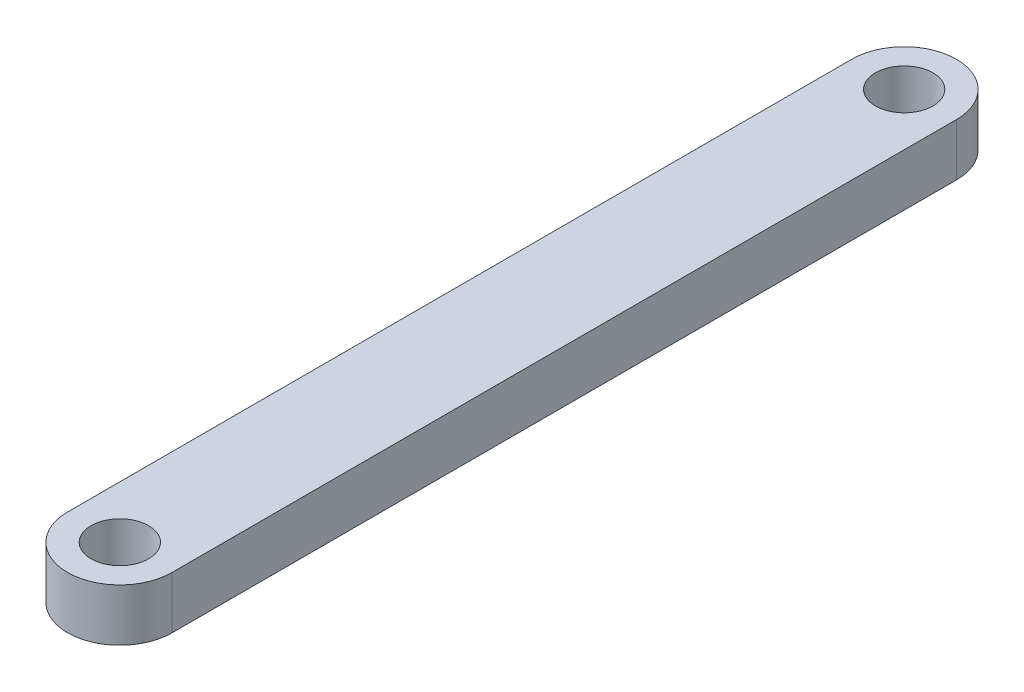
ISO-10303-21;
HEADER;
FILE_DESCRIPTION(('STEP AP214'),'2;1');
FILE_NAME('part.step','',(''),(''),'','','');
FILE_SCHEMA(('AUTOMOTIVE_DESIGN { 1 0 10303 214 1 1 1 1 }'));
ENDSEC;
DATA;
#1=APPLICATION_CONTEXT('core data for automotive mechanical design processes');
#2=APPLICATION_PROTOCOL_DEFINITION('international standard','automotive_design',2000,#1);
#3=PRODUCT_CONTEXT('',#1,'mechanical');
#4=PRODUCT('Part','Part','',(#3));
#5=PRODUCT_RELATED_PRODUCT_CATEGORY('part','',(#4));
#6=PRODUCT_DEFINITION_FORMATION('','',#4);
#7=PRODUCT_DEFINITION_CONTEXT('part definition',#1,'design');
#8=PRODUCT_DEFINITION('design','',#6,#7);
#9=PRODUCT_DEFINITION_SHAPE('','',#8);
#10=(LENGTH_UNIT() NAMED_UNIT(*) SI_UNIT(.MILLI.,.METRE.));
#11=(NAMED_UNIT(*) PLANE_ANGLE_UNIT() SI_UNIT($,.RADIAN.));
#12=(NAMED_UNIT(*) SI_UNIT($,.STERADIAN.) SOLID_ANGLE_UNIT());
#13=UNCERTAINTY_MEASURE_WITH_UNIT(LENGTH_MEASURE(1.E-05),#10,'distance_accuracy_value','');
#14=(GEOMETRIC_REPRESENTATION_CONTEXT(3) GLOBAL_UNCERTAINTY_ASSIGNED_CONTEXT((#13)) GLOBAL_UNIT_ASSIGNED_CONTEXT((#10,
#11,#12)) REPRESENTATION_CONTEXT('',''));
#15=CARTESIAN_POINT('',(0.,0.,0.));
#16=DIRECTION('',(0.,0.,1.));
#17=DIRECTION('',(1.,0.,0.));
#18=AXIS2_PLACEMENT_3D('',#15,#16,#17);
#19=CARTESIAN_POINT('',(-4.99999999999999,5.,0.));
#20=DIRECTION('',(1.,0.,0.));
#21=DIRECTION('',(0.,0.,-1.));
#22=AXIS2_PLACEMENT_3D('',#19,#20,#21);
#23=PLANE('',#22);
#24=DIRECTION('',(0.,0.,1.));
#25=VECTOR('',#24,1.);
#26=CARTESIAN_POINT('',(-4.99999999999999,0.,0.));
#27=LINE('',#26,#25);
#28=CARTESIAN_POINT('',(-5.,0.,-75.));
#29=VERTEX_POINT('',#28);
#30=CARTESIAN_POINT('',(-4.99999999999999,0.,0.));
#31=VERTEX_POINT('',#30);
#32=EDGE_CURVE('E102',#29,#31,#27,.T.);
#33=ORIENTED_EDGE('',*,*,#32,.T.);
#34=DIRECTION('',(0.,-1.,0.));
#35=VECTOR('',#34,1.);
#36=CARTESIAN_POINT('',(-4.99999999999999,5.,0.));
#37=LINE('',#36,#35);
#38=CARTESIAN_POINT('',(-4.99999999999999,5.,0.));
#39=VERTEX_POINT('',#38);
#40=EDGE_CURVE('E11',#39,#31,#37,.T.);
#41=ORIENTED_EDGE('',*,*,#40,.F.);
#42=DIRECTION('',(0.,0.,1.));
#43=VECTOR('',#42,1.);
#44=CARTESIAN_POINT('',(-4.99999999999999,5.,0.));
#45=LINE('',#44,#43);
#46=CARTESIAN_POINT('',(-5.,5.,-75.));
#47=VERTEX_POINT('',#46);
#48=EDGE_CURVE('E81',#47,#39,#45,.T.);
#49=ORIENTED_EDGE('',*,*,#48,.F.);
#50=DIRECTION('',(0.,-1.,0.));
#51=VECTOR('',#50,1.);
#52=CARTESIAN_POINT('',(-5.,5.,-75.));
#53=LINE('',#52,#51);
#54=EDGE_CURVE('E92',#47,#29,#53,.T.);
#55=ORIENTED_EDGE('',*,*,#54,.T.);
#56=EDGE_LOOP('',(#33,#41,#49,#55));
#57=FACE_BOUND('',#56,.T.);
#58=ADVANCED_FACE('F33',(#57),#23,.F.);
#59=CARTESIAN_POINT('',(0.,5.,0.));
#60=DIRECTION('',(0.,-1.,0.));
#61=DIRECTION('',(0.,0.,-1.));
#62=AXIS2_PLACEMENT_3D('',#59,#60,#61);
#63=CYLINDRICAL_SURFACE('',#62,5.);
#64=CARTESIAN_POINT('',(0.,0.,0.));
#65=DIRECTION('',(0.,1.,0.));
#66=DIRECTION('',(0.,0.,1.));
#67=AXIS2_PLACEMENT_3D('',#64,#65,#66);
#68=CIRCLE('',#67,5.);
#69=CARTESIAN_POINT('',(5.00000000000001,0.,0.));
#70=VERTEX_POINT('',#69);
#71=EDGE_CURVE('E86',#31,#70,#68,.T.);
#72=ORIENTED_EDGE('',*,*,#71,.T.);
#73=DIRECTION('',(0.,-1.,0.));
#74=VECTOR('',#73,1.);
#75=CARTESIAN_POINT('',(5.00000000000001,5.,0.));
#76=LINE('',#75,#74);
#77=CARTESIAN_POINT('',(5.00000000000001,5.,0.));
#78=VERTEX_POINT('',#77);
#79=EDGE_CURVE('E42',#78,#70,#76,.T.);
#80=ORIENTED_EDGE('',*,*,#79,.F.);
#81=CARTESIAN_POINT('',(0.,5.,0.));
#82=DIRECTION('',(0.,1.,0.));
#83=DIRECTION('',(0.,0.,1.));
#84=AXIS2_PLACEMENT_3D('',#81,#82,#83);
#85=CIRCLE('',#84,5.);
#86=EDGE_CURVE('E76',#39,#78,#85,.T.);
#87=ORIENTED_EDGE('',*,*,#86,.F.);
#88=ORIENTED_EDGE('',*,*,#40,.T.);
#89=EDGE_LOOP('',(#72,#80,#87,#88));
#90=FACE_BOUND('',#89,.T.);
#91=ADVANCED_FACE('F85',(#90),#63,.T.);
#92=CARTESIAN_POINT('',(5.00000000000001,5.,0.));
#93=DIRECTION('',(1.,0.,0.));
#94=DIRECTION('',(0.,0.,-1.));
#95=AXIS2_PLACEMENT_3D('',#92,#93,#94);
#96=PLANE('',#95);
#97=DIRECTION('',(0.,0.,1.));
#98=VECTOR('',#97,1.);
#99=CARTESIAN_POINT('',(5.00000000000001,0.,0.));
#100=LINE('',#99,#98);
#101=CARTESIAN_POINT('',(5.,0.,-75.));
#102=VERTEX_POINT('',#101);
#103=EDGE_CURVE('E106',#102,#70,#100,.T.);
#104=ORIENTED_EDGE('',*,*,#103,.F.);
#105=DIRECTION('',(0.,-1.,0.));
#106=VECTOR('',#105,1.);
#107=CARTESIAN_POINT('',(5.,5.,-75.));
#108=LINE('',#107,#106);
#109=CARTESIAN_POINT('',(5.,5.,-75.));
#110=VERTEX_POINT('',#109);
#111=EDGE_CURVE('E66',#110,#102,#108,.T.);
#112=ORIENTED_EDGE('',*,*,#111,.F.);
#113=DIRECTION('',(0.,0.,1.));
#114=VECTOR('',#113,1.);
#115=CARTESIAN_POINT('',(5.00000000000001,5.,0.));
#116=LINE('',#115,#114);
#117=EDGE_CURVE('E79',#110,#78,#116,.T.);
#118=ORIENTED_EDGE('',*,*,#117,.T.);
#119=ORIENTED_EDGE('',*,*,#79,.T.);
#120=EDGE_LOOP('',(#104,#112,#118,#119));
#121=FACE_BOUND('',#120,.T.);
#122=ADVANCED_FACE('F90',(#121),#96,.T.);
#123=CARTESIAN_POINT('',(0.,5.,0.));
#124=DIRECTION('',(0.,-1.,0.));
#125=DIRECTION('',(0.,0.,-1.));
#126=AXIS2_PLACEMENT_3D('',#123,#124,#125);
#127=CYLINDRICAL_SURFACE('',#126,2.75);
#128=CARTESIAN_POINT('',(0.,5.,0.));
#129=DIRECTION('',(0.,1.,0.));
#130=DIRECTION('',(0.,0.,1.));
#131=AXIS2_PLACEMENT_3D('',#128,#129,#130);
#132=CIRCLE('',#131,2.75);
#133=CARTESIAN_POINT('',(0.,5.,2.75));
#134=VERTEX_POINT('',#133);
#135=EDGE_CURVE('E144',#134,#134,#132,.T.);
#136=ORIENTED_EDGE('',*,*,#135,.T.);
#137=EDGE_LOOP('',(#136));
#138=FACE_BOUND('',#137,.T.);
#139=CARTESIAN_POINT('',(0.,0.,0.));
#140=DIRECTION('',(0.,1.,0.));
#141=DIRECTION('',(0.,0.,1.));
#142=AXIS2_PLACEMENT_3D('',#139,#140,#141);
#143=CIRCLE('',#142,2.75);
#144=CARTESIAN_POINT('',(0.,0.,2.75));
#145=VERTEX_POINT('',#144);
#146=EDGE_CURVE('E99',#145,#145,#143,.T.);
#147=ORIENTED_EDGE('',*,*,#146,.F.);
#148=EDGE_LOOP('',(#147));
#149=FACE_BOUND('',#148,.T.);
#150=ADVANCED_FACE('F133',(#138,#149),#127,.F.);
#151=CARTESIAN_POINT('',(0.,5.,-75.));
#152=DIRECTION('',(0.,-1.,0.));
#153=DIRECTION('',(0.,0.,-1.));
#154=AXIS2_PLACEMENT_3D('',#151,#152,#153);
#155=CYLINDRICAL_SURFACE('',#154,2.75);
#156=CARTESIAN_POINT('',(0.,5.,-75.));
#157=DIRECTION('',(0.,1.,0.));
#158=DIRECTION('',(0.,0.,1.));
#159=AXIS2_PLACEMENT_3D('',#156,#157,#158);
#160=CIRCLE('',#159,2.75);
#161=CARTESIAN_POINT('',(0.,5.,-72.25));
#162=VERTEX_POINT('',#161);
#163=EDGE_CURVE('E109',#162,#162,#160,.T.);
#164=ORIENTED_EDGE('',*,*,#163,.T.);
#165=EDGE_LOOP('',(#164));
#166=FACE_BOUND('',#165,.T.);
#167=CARTESIAN_POINT('',(0.,0.,-75.));
#168=DIRECTION('',(0.,1.,0.));
#169=DIRECTION('',(0.,0.,1.));
#170=AXIS2_PLACEMENT_3D('',#167,#168,#169);
#171=CIRCLE('',#170,2.75);
#172=CARTESIAN_POINT('',(0.,0.,-72.25));
#173=VERTEX_POINT('',#172);
#174=EDGE_CURVE('E96',#173,#173,#171,.T.);
#175=ORIENTED_EDGE('',*,*,#174,.F.);
#176=EDGE_LOOP('',(#175));
#177=FACE_BOUND('',#176,.T.);
#178=ADVANCED_FACE('F35',(#166,#177),#155,.F.);
#179=CARTESIAN_POINT('',(0.,5.,-75.));
#180=DIRECTION('',(0.,-1.,0.));
#181=DIRECTION('',(0.,0.,-1.));
#182=AXIS2_PLACEMENT_3D('',#179,#180,#181);
#183=CYLINDRICAL_SURFACE('',#182,5.);
#184=CARTESIAN_POINT('',(0.,0.,-75.));
#185=DIRECTION('',(0.,1.,0.));
#186=DIRECTION('',(0.,0.,1.));
#187=AXIS2_PLACEMENT_3D('',#184,#185,#186);
#188=CIRCLE('',#187,5.);
#189=EDGE_CURVE('E69',#102,#29,#188,.T.);
#190=ORIENTED_EDGE('',*,*,#189,.T.);
#191=ORIENTED_EDGE('',*,*,#54,.F.);
#192=CARTESIAN_POINT('',(0.,5.,-75.));
#193=DIRECTION('',(0.,1.,0.));
#194=DIRECTION('',(0.,0.,1.));
#195=AXIS2_PLACEMENT_3D('',#192,#193,#194);
#196=CIRCLE('',#195,5.);
#197=EDGE_CURVE('E50',#110,#47,#196,.T.);
#198=ORIENTED_EDGE('',*,*,#197,.F.);
#199=ORIENTED_EDGE('',*,*,#111,.T.);
#200=EDGE_LOOP('',(#190,#191,#198,#199));
#201=FACE_BOUND('',#200,.T.);
#202=ADVANCED_FACE('F121',(#201),#183,.T.);
#203=CARTESIAN_POINT('',(0.,5.,0.));
#204=DIRECTION('',(0.,1.,0.));
#205=DIRECTION('',(0.,0.,1.));
#206=AXIS2_PLACEMENT_3D('',#203,#204,#205);
#207=PLANE('',#206);
#208=ORIENTED_EDGE('',*,*,#163,.F.);
#209=EDGE_LOOP('',(#208));
#210=FACE_BOUND('',#209,.T.);
#211=ORIENTED_EDGE('',*,*,#135,.F.);
#212=EDGE_LOOP('',(#211));
#213=FACE_BOUND('',#212,.T.);
#214=ORIENTED_EDGE('',*,*,#48,.T.);
#215=ORIENTED_EDGE('',*,*,#86,.T.);
#216=ORIENTED_EDGE('',*,*,#117,.F.);
#217=ORIENTED_EDGE('',*,*,#197,.T.);
#218=EDGE_LOOP('',(#214,#215,#216,#217));
#219=FACE_BOUND('',#218,.T.);
#220=ADVANCED_FACE('F77',(#210,#213,#219),#207,.T.);
#221=CARTESIAN_POINT('',(0.,0.,0.));
#222=DIRECTION('',(0.,1.,0.));
#223=DIRECTION('',(0.,0.,1.));
#224=AXIS2_PLACEMENT_3D('',#221,#222,#223);
#225=PLANE('',#224);
#226=ORIENTED_EDGE('',*,*,#174,.T.);
#227=EDGE_LOOP('',(#226));
#228=FACE_BOUND('',#227,.T.);
#229=ORIENTED_EDGE('',*,*,#146,.T.);
#230=EDGE_LOOP('',(#229));
#231=FACE_BOUND('',#230,.T.);
#232=ORIENTED_EDGE('',*,*,#32,.F.);
#233=ORIENTED_EDGE('',*,*,#189,.F.);
#234=ORIENTED_EDGE('',*,*,#103,.T.);
#235=ORIENTED_EDGE('',*,*,#71,.F.);
#236=EDGE_LOOP('',(#232,#233,#234,#235));
#237=FACE_BOUND('',#236,.T.);
#238=ADVANCED_FACE('F114',(#228,#231,#237),#225,.F.);
#239=CLOSED_SHELL('',(#58,#91,#122,#150,#178,#202,#220,#238));
#240=MANIFOLD_SOLID_BREP('B2',#239);
#241=ADVANCED_BREP_SHAPE_REPRESENTATION('',(#18,#240),#14);
#242=SHAPE_DEFINITION_REPRESENTATION(#9,#241);
ENDSEC;
END-ISO-10303-21;
